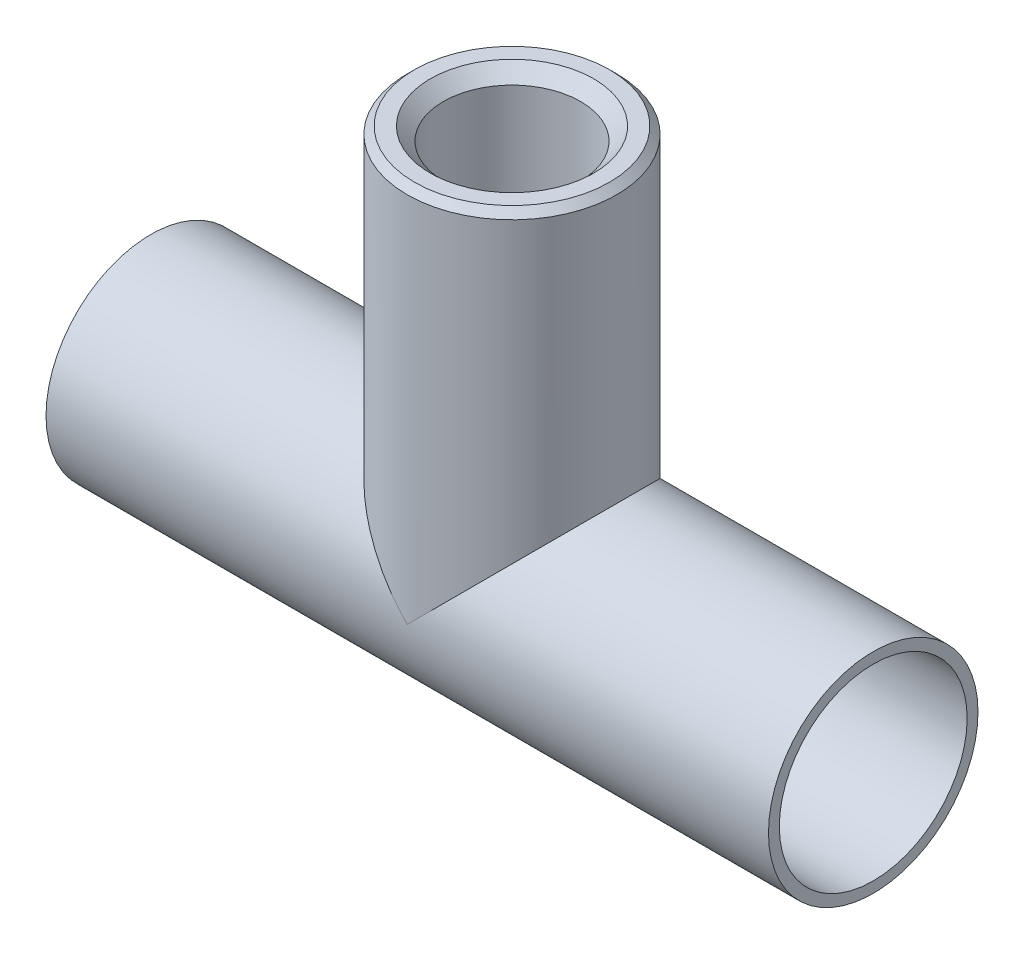
ISO-10303-21;
HEADER;
FILE_DESCRIPTION(('STEP AP214'),'2;1');
FILE_NAME('part.step','',(''),(''),'','','');
FILE_SCHEMA(('AUTOMOTIVE_DESIGN { 1 0 10303 214 1 1 1 1 }'));
ENDSEC;
DATA;
#1=APPLICATION_CONTEXT('core data for automotive mechanical design processes');
#2=APPLICATION_PROTOCOL_DEFINITION('international standard','automotive_design',2000,#1);
#3=PRODUCT_CONTEXT('',#1,'mechanical');
#4=PRODUCT('Part','Part','',(#3));
#5=PRODUCT_RELATED_PRODUCT_CATEGORY('part','',(#4));
#6=PRODUCT_DEFINITION_FORMATION('','',#4);
#7=PRODUCT_DEFINITION_CONTEXT('part definition',#1,'design');
#8=PRODUCT_DEFINITION('design','',#6,#7);
#9=PRODUCT_DEFINITION_SHAPE('','',#8);
#10=(LENGTH_UNIT() NAMED_UNIT(*) SI_UNIT(.MILLI.,.METRE.));
#11=(NAMED_UNIT(*) PLANE_ANGLE_UNIT() SI_UNIT($,.RADIAN.));
#12=(NAMED_UNIT(*) SI_UNIT($,.STERADIAN.) SOLID_ANGLE_UNIT());
#13=UNCERTAINTY_MEASURE_WITH_UNIT(LENGTH_MEASURE(1.E-05),#10,'distance_accuracy_value','');
#14=(GEOMETRIC_REPRESENTATION_CONTEXT(3) GLOBAL_UNCERTAINTY_ASSIGNED_CONTEXT((#13)) GLOBAL_UNIT_ASSIGNED_CONTEXT((#10,
#11,#12)) REPRESENTATION_CONTEXT('',''));
#15=CARTESIAN_POINT('',(0.,0.,0.));
#16=DIRECTION('',(0.,0.,1.));
#17=DIRECTION('',(1.,0.,0.));
#18=AXIS2_PLACEMENT_3D('',#15,#16,#17);
#19=CARTESIAN_POINT('',(0.,32.5,0.));
#20=DIRECTION('',(0.,1.,0.));
#21=DIRECTION('',(0.,0.,-1.));
#22=AXIS2_PLACEMENT_3D('',#19,#20,#21);
#23=CYLINDRICAL_SURFACE('',#22,13.);
#24=CARTESIAN_POINT('',(0.,0.,0.));
#25=DIRECTION('',(-0.707106781186548,0.707106781186548,0.));
#26=DIRECTION('',(0.707106781186548,0.707106781186548,0.));
#27=AXIS2_PLACEMENT_3D('',#24,#25,#26);
#28=ELLIPSE('',#27,18.3847763109,13.);
#29=CARTESIAN_POINT('',(0.,0.,13.));
#30=VERTEX_POINT('',#29);
#31=CARTESIAN_POINT('',(0.,0.,-13.));
#32=VERTEX_POINT('',#31);
#33=EDGE_CURVE('E73',#30,#32,#28,.T.);
#34=ORIENTED_EDGE('',*,*,#33,.F.);
#35=CARTESIAN_POINT('',(0.,0.,0.));
#36=DIRECTION('',(0.707106781186548,0.707106781186548,0.));
#37=DIRECTION('',(0.707106781186548,-0.707106781186548,0.));
#38=AXIS2_PLACEMENT_3D('',#35,#36,#37);
#39=ELLIPSE('',#38,18.3847763109,13.);
#40=EDGE_CURVE('E83',#32,#30,#39,.T.);
#41=ORIENTED_EDGE('',*,*,#40,.F.);
#42=EDGE_LOOP('',(#34,#41));
#43=FACE_BOUND('',#42,.T.);
#44=CARTESIAN_POINT('',(0.,15.3,0.));
#45=DIRECTION('',(0.,-1.,0.));
#46=DIRECTION('',(0.,0.,-1.));
#47=AXIS2_PLACEMENT_3D('',#44,#45,#46);
#48=CIRCLE('',#47,13.);
#49=CARTESIAN_POINT('',(0.,15.3,-13.));
#50=VERTEX_POINT('',#49);
#51=EDGE_CURVE('E11',#50,#50,#48,.T.);
#52=ORIENTED_EDGE('',*,*,#51,.F.);
#53=EDGE_LOOP('',(#52));
#54=FACE_BOUND('',#53,.T.);
#55=ADVANCED_FACE('F16',(#43,#54),#23,.F.);
#56=CARTESIAN_POINT('',(0.,15.3,0.));
#57=DIRECTION('',(0.,-1.,0.));
#58=DIRECTION('',(0.,0.,-1.));
#59=AXIS2_PLACEMENT_3D('',#56,#57,#58);
#60=TOROIDAL_SURFACE('',#59,9.8,3.2);
#61=CARTESIAN_POINT('',(0.,18.5,0.));
#62=DIRECTION('',(0.,-1.,0.));
#63=DIRECTION('',(0.,0.,-1.));
#64=AXIS2_PLACEMENT_3D('',#61,#62,#63);
#65=CIRCLE('',#64,9.8);
#66=CARTESIAN_POINT('',(0.,18.5,-9.8));
#67=VERTEX_POINT('',#66);
#68=EDGE_CURVE('E27',#67,#67,#65,.T.);
#69=ORIENTED_EDGE('',*,*,#68,.F.);
#70=EDGE_LOOP('',(#69));
#71=FACE_BOUND('',#70,.T.);
#72=ORIENTED_EDGE('',*,*,#51,.T.);
#73=EDGE_LOOP('',(#72));
#74=FACE_BOUND('',#73,.T.);
#75=ADVANCED_FACE('F133',(#71,#74),#60,.F.);
#76=CARTESIAN_POINT('',(9.09738144111314,18.5,0.));
#77=DIRECTION('',(0.,-1.,0.));
#78=DIRECTION('',(0.,0.,-1.));
#79=AXIS2_PLACEMENT_3D('',#76,#77,#78);
#80=PLANE('',#79);
#81=CARTESIAN_POINT('',(0.,18.5,0.));
#82=DIRECTION('',(0.,-1.,0.));
#83=DIRECTION('',(0.,0.,-1.));
#84=AXIS2_PLACEMENT_3D('',#81,#82,#83);
#85=CIRCLE('',#84,9.0973814411);
#86=CARTESIAN_POINT('',(0.,18.5,-9.09738144111314));
#87=VERTEX_POINT('',#86);
#88=EDGE_CURVE('E51',#87,#87,#85,.T.);
#89=ORIENTED_EDGE('',*,*,#88,.F.);
#90=EDGE_LOOP('',(#89));
#91=FACE_BOUND('',#90,.T.);
#92=ORIENTED_EDGE('',*,*,#68,.T.);
#93=EDGE_LOOP('',(#92));
#94=FACE_BOUND('',#93,.T.);
#95=ADVANCED_FACE('F128',(#91,#94),#80,.T.);
#96=CARTESIAN_POINT('',(0.,18.9,0.));
#97=DIRECTION('',(0.,-1.,0.));
#98=DIRECTION('',(0.,0.,-1.));
#99=AXIS2_PLACEMENT_3D('',#96,#97,#98);
#100=CONICAL_SURFACE('',#99,7.9983904733,1.2217304764);
#101=CARTESIAN_POINT('',(0.,18.9,0.));
#102=DIRECTION('',(0.,-1.,0.));
#103=DIRECTION('',(0.,0.,-1.));
#104=AXIS2_PLACEMENT_3D('',#101,#102,#103);
#105=CIRCLE('',#104,7.9983904733);
#106=CARTESIAN_POINT('',(0.,18.9,-7.99839047333129));
#107=VERTEX_POINT('',#106);
#108=EDGE_CURVE('E55',#107,#107,#105,.T.);
#109=ORIENTED_EDGE('',*,*,#108,.F.);
#110=EDGE_LOOP('',(#109));
#111=FACE_BOUND('',#110,.T.);
#112=ORIENTED_EDGE('',*,*,#88,.T.);
#113=EDGE_LOOP('',(#112));
#114=FACE_BOUND('',#113,.T.);
#115=ADVANCED_FACE('F52',(#111,#114),#100,.F.);
#116=CARTESIAN_POINT('',(0.,20.16,0.));
#117=DIRECTION('',(0.,1.,0.));
#118=DIRECTION('',(0.,0.,1.));
#119=AXIS2_PLACEMENT_3D('',#116,#117,#118);
#120=CONICAL_SURFACE('',#119,9.5,0.872664626);
#121=ORIENTED_EDGE('',*,*,#108,.T.);
#122=EDGE_LOOP('',(#121));
#123=FACE_BOUND('',#122,.T.);
#124=CARTESIAN_POINT('',(0.,20.16,0.));
#125=DIRECTION('',(0.,-1.,0.));
#126=DIRECTION('',(0.,0.,-1.));
#127=AXIS2_PLACEMENT_3D('',#124,#125,#126);
#128=CIRCLE('',#127,9.5);
#129=CARTESIAN_POINT('',(0.,20.16,-9.5));
#130=VERTEX_POINT('',#129);
#131=EDGE_CURVE('E62',#130,#130,#128,.T.);
#132=ORIENTED_EDGE('',*,*,#131,.F.);
#133=EDGE_LOOP('',(#132));
#134=FACE_BOUND('',#133,.T.);
#135=ADVANCED_FACE('F117',(#123,#134),#120,.F.);
#136=CARTESIAN_POINT('',(0.,32.5,0.));
#137=DIRECTION('',(0.,1.,0.));
#138=DIRECTION('',(0.,0.,-1.));
#139=AXIS2_PLACEMENT_3D('',#136,#137,#138);
#140=CYLINDRICAL_SURFACE('',#139,9.5);
#141=ORIENTED_EDGE('',*,*,#131,.T.);
#142=EDGE_LOOP('',(#141));
#143=FACE_BOUND('',#142,.T.);
#144=CARTESIAN_POINT('',(0.,50.6845,0.));
#145=DIRECTION('',(0.,-1.,0.));
#146=DIRECTION('',(0.,0.,1.));
#147=AXIS2_PLACEMENT_3D('',#144,#145,#146);
#148=CIRCLE('',#147,9.5);
#149=CARTESIAN_POINT('',(0.,50.6845,9.5));
#150=VERTEX_POINT('',#149);
#151=EDGE_CURVE('E89',#150,#150,#148,.T.);
#152=ORIENTED_EDGE('',*,*,#151,.F.);
#153=EDGE_LOOP('',(#152));
#154=FACE_BOUND('',#153,.T.);
#155=ADVANCED_FACE('F113',(#143,#154),#140,.F.);
#156=CARTESIAN_POINT('',(0.,52.5,0.));
#157=DIRECTION('',(0.,-1.,0.));
#158=DIRECTION('',(0.,0.,-1.));
#159=AXIS2_PLACEMENT_3D('',#156,#157,#158);
#160=PLANE('',#159);
#161=CARTESIAN_POINT('',(0.,52.5,0.));
#162=DIRECTION('',(0.,-1.,0.));
#163=DIRECTION('',(0.,0.,-1.));
#164=AXIS2_PLACEMENT_3D('',#161,#162,#163);
#165=CIRCLE('',#164,11.3155);
#166=CARTESIAN_POINT('',(0.,52.5,-11.3155));
#167=VERTEX_POINT('',#166);
#168=EDGE_CURVE('E88',#167,#167,#165,.T.);
#169=ORIENTED_EDGE('',*,*,#168,.T.);
#170=EDGE_LOOP('',(#169));
#171=FACE_BOUND('',#170,.T.);
#172=CARTESIAN_POINT('',(0.,52.5,0.));
#173=DIRECTION('',(0.,-1.,0.));
#174=DIRECTION('',(0.,0.,-1.));
#175=AXIS2_PLACEMENT_3D('',#172,#173,#174);
#176=CIRCLE('',#175,13.5);
#177=CARTESIAN_POINT('',(0.,52.5,-13.5));
#178=VERTEX_POINT('',#177);
#179=EDGE_CURVE('E65',#178,#178,#176,.T.);
#180=ORIENTED_EDGE('',*,*,#179,.F.);
#181=EDGE_LOOP('',(#180));
#182=FACE_BOUND('',#181,.T.);
#183=ADVANCED_FACE('F126',(#171,#182),#160,.F.);
#184=CARTESIAN_POINT('',(0.,52.5,0.));
#185=DIRECTION('',(0.,-1.,0.));
#186=DIRECTION('',(0.,0.,-1.));
#187=AXIS2_PLACEMENT_3D('',#184,#185,#186);
#188=CONICAL_SURFACE('',#187,13.5,0.7853981634);
#189=ORIENTED_EDGE('',*,*,#179,.T.);
#190=EDGE_LOOP('',(#189));
#191=FACE_BOUND('',#190,.T.);
#192=CARTESIAN_POINT('',(0.,51.5,0.));
#193=DIRECTION('',(0.,-1.,0.));
#194=DIRECTION('',(0.,0.,-1.));
#195=AXIS2_PLACEMENT_3D('',#192,#193,#194);
#196=CIRCLE('',#195,14.5);
#197=CARTESIAN_POINT('',(0.,51.5,-14.5));
#198=VERTEX_POINT('',#197);
#199=EDGE_CURVE('E68',#198,#198,#196,.T.);
#200=ORIENTED_EDGE('',*,*,#199,.F.);
#201=EDGE_LOOP('',(#200));
#202=FACE_BOUND('',#201,.T.);
#203=ADVANCED_FACE('F146',(#191,#202),#188,.T.);
#204=CARTESIAN_POINT('',(0.,0.,0.));
#205=DIRECTION('',(0.,1.,0.));
#206=DIRECTION('',(0.,0.,-1.));
#207=AXIS2_PLACEMENT_3D('',#204,#205,#206);
#208=CYLINDRICAL_SURFACE('',#207,14.5);
#209=CARTESIAN_POINT('',(0.,0.,0.));
#210=DIRECTION('',(0.707106781186548,0.707106781186548,0.));
#211=DIRECTION('',(0.707106781186548,-0.707106781186548,0.));
#212=AXIS2_PLACEMENT_3D('',#209,#210,#211);
#213=ELLIPSE('',#212,20.5060966544,14.5);
#214=CARTESIAN_POINT('',(0.,0.,-14.5));
#215=VERTEX_POINT('',#214);
#216=CARTESIAN_POINT('',(0.,0.,14.5));
#217=VERTEX_POINT('',#216);
#218=EDGE_CURVE('E79',#215,#217,#213,.T.);
#219=ORIENTED_EDGE('',*,*,#218,.T.);
#220=CARTESIAN_POINT('',(0.,0.,0.));
#221=DIRECTION('',(-0.707106781186548,0.707106781186548,0.));
#222=DIRECTION('',(0.707106781186548,0.707106781186548,0.));
#223=AXIS2_PLACEMENT_3D('',#220,#221,#222);
#224=ELLIPSE('',#223,20.5060966544,14.5);
#225=EDGE_CURVE('E84',#217,#215,#224,.T.);
#226=ORIENTED_EDGE('',*,*,#225,.T.);
#227=EDGE_LOOP('',(#219,#226));
#228=FACE_BOUND('',#227,.T.);
#229=ORIENTED_EDGE('',*,*,#199,.T.);
#230=EDGE_LOOP('',(#229));
#231=FACE_BOUND('',#230,.T.);
#232=ADVANCED_FACE('F149',(#228,#231),#208,.T.);
#233=CARTESIAN_POINT('',(0.,52.5,0.));
#234=DIRECTION('',(0.,1.,0.));
#235=DIRECTION('',(0.,0.,1.));
#236=AXIS2_PLACEMENT_3D('',#233,#234,#235);
#237=CONICAL_SURFACE('',#236,11.3155,0.7853981634);
#238=ORIENTED_EDGE('',*,*,#151,.T.);
#239=EDGE_LOOP('',(#238));
#240=FACE_BOUND('',#239,.T.);
#241=ORIENTED_EDGE('',*,*,#168,.F.);
#242=EDGE_LOOP('',(#241));
#243=FACE_BOUND('',#242,.T.);
#244=ADVANCED_FACE('F144',(#240,#243),#237,.F.);
#245=CARTESIAN_POINT('',(-50.,0.,0.));
#246=DIRECTION('',(1.,0.,0.));
#247=DIRECTION('',(0.,1.,0.));
#248=AXIS2_PLACEMENT_3D('',#245,#246,#247);
#249=PLANE('',#248);
#250=CARTESIAN_POINT('',(-50.,0.,0.));
#251=DIRECTION('',(-1.,0.,0.));
#252=DIRECTION('',(0.,0.,-1.));
#253=AXIS2_PLACEMENT_3D('',#250,#251,#252);
#254=CIRCLE('',#253,13.);
#255=CARTESIAN_POINT('',(-50.,0.,-13.));
#256=VERTEX_POINT('',#255);
#257=EDGE_CURVE('E74',#256,#256,#254,.T.);
#258=ORIENTED_EDGE('',*,*,#257,.F.);
#259=EDGE_LOOP('',(#258));
#260=FACE_BOUND('',#259,.T.);
#261=CARTESIAN_POINT('',(-50.,0.,0.));
#262=DIRECTION('',(1.,0.,0.));
#263=DIRECTION('',(0.,0.,-1.));
#264=AXIS2_PLACEMENT_3D('',#261,#262,#263);
#265=CIRCLE('',#264,14.5);
#266=CARTESIAN_POINT('',(-50.,0.,-14.5));
#267=VERTEX_POINT('',#266);
#268=EDGE_CURVE('E75',#267,#267,#265,.T.);
#269=ORIENTED_EDGE('',*,*,#268,.F.);
#270=EDGE_LOOP('',(#269));
#271=FACE_BOUND('',#270,.T.);
#272=ADVANCED_FACE('F230',(#260,#271),#249,.F.);
#273=CARTESIAN_POINT('',(50.,0.,0.));
#274=DIRECTION('',(-1.,0.,0.));
#275=DIRECTION('',(0.,0.,-1.));
#276=AXIS2_PLACEMENT_3D('',#273,#274,#275);
#277=CYLINDRICAL_SURFACE('',#276,14.5);
#278=ORIENTED_EDGE('',*,*,#218,.F.);
#279=ORIENTED_EDGE('',*,*,#225,.F.);
#280=EDGE_LOOP('',(#278,#279));
#281=FACE_BOUND('',#280,.T.);
#282=CARTESIAN_POINT('',(50.,0.,0.));
#283=DIRECTION('',(1.,0.,0.));
#284=DIRECTION('',(0.,0.,-1.));
#285=AXIS2_PLACEMENT_3D('',#282,#283,#284);
#286=CIRCLE('',#285,14.5);
#287=CARTESIAN_POINT('',(50.,0.,-14.5));
#288=VERTEX_POINT('',#287);
#289=EDGE_CURVE('E20',#288,#288,#286,.T.);
#290=ORIENTED_EDGE('',*,*,#289,.F.);
#291=EDGE_LOOP('',(#290));
#292=FACE_BOUND('',#291,.T.);
#293=ORIENTED_EDGE('',*,*,#268,.T.);
#294=EDGE_LOOP('',(#293));
#295=FACE_BOUND('',#294,.T.);
#296=ADVANCED_FACE('F18',(#281,#292,#295),#277,.T.);
#297=CARTESIAN_POINT('',(50.,14.5,0.));
#298=DIRECTION('',(-1.,0.,0.));
#299=DIRECTION('',(0.,0.,1.));
#300=AXIS2_PLACEMENT_3D('',#297,#298,#299);
#301=PLANE('',#300);
#302=CARTESIAN_POINT('',(50.,0.,0.));
#303=DIRECTION('',(1.,0.,0.));
#304=DIRECTION('',(0.,0.,1.));
#305=AXIS2_PLACEMENT_3D('',#302,#303,#304);
#306=CIRCLE('',#305,13.);
#307=CARTESIAN_POINT('',(50.,0.,13.));
#308=VERTEX_POINT('',#307);
#309=EDGE_CURVE('E69',#308,#308,#306,.T.);
#310=ORIENTED_EDGE('',*,*,#309,.F.);
#311=EDGE_LOOP('',(#310));
#312=FACE_BOUND('',#311,.T.);
#313=ORIENTED_EDGE('',*,*,#289,.T.);
#314=EDGE_LOOP('',(#313));
#315=FACE_BOUND('',#314,.T.);
#316=ADVANCED_FACE('F153',(#312,#315),#301,.F.);
#317=CARTESIAN_POINT('',(55.,0.,0.));
#318=DIRECTION('',(-1.,0.,0.));
#319=DIRECTION('',(0.,0.,-1.));
#320=AXIS2_PLACEMENT_3D('',#317,#318,#319);
#321=CYLINDRICAL_SURFACE('',#320,13.);
#322=ORIENTED_EDGE('',*,*,#33,.T.);
#323=ORIENTED_EDGE('',*,*,#40,.T.);
#324=EDGE_LOOP('',(#322,#323));
#325=FACE_BOUND('',#324,.T.);
#326=ORIENTED_EDGE('',*,*,#309,.T.);
#327=EDGE_LOOP('',(#326));
#328=FACE_BOUND('',#327,.T.);
#329=ORIENTED_EDGE('',*,*,#257,.T.);
#330=EDGE_LOOP('',(#329));
#331=FACE_BOUND('',#330,.T.);
#332=ADVANCED_FACE('F156',(#325,#328,#331),#321,.F.);
#333=CLOSED_SHELL('',(#55,#75,#95,#115,#135,#155,#183,#203,#232,#244,#272,#296,#316,#332));
#334=MANIFOLD_SOLID_BREP('B1',#333);
#335=ADVANCED_BREP_SHAPE_REPRESENTATION('',(#18,#334),#14);
#336=SHAPE_DEFINITION_REPRESENTATION(#9,#335);
ENDSEC;
END-ISO-10303-21;
